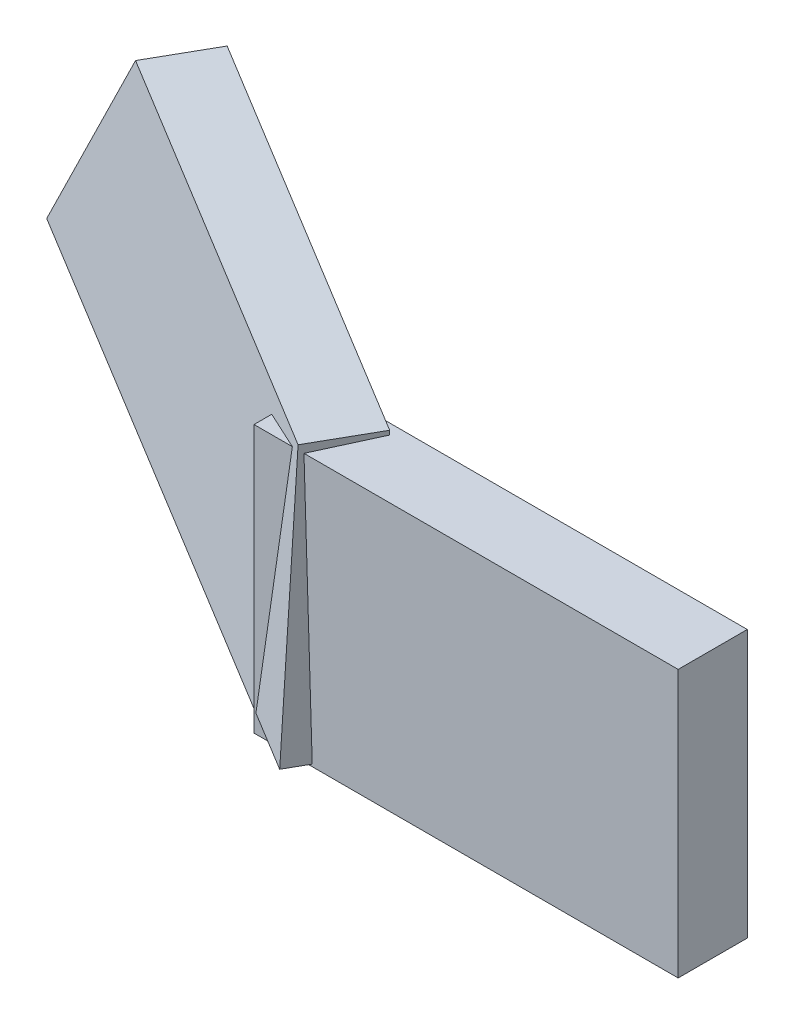
ISO-10303-21;
HEADER;
FILE_DESCRIPTION(('STEP AP214'),'2;1');
FILE_NAME('part.step','',(''),(''),'','','');
FILE_SCHEMA(('AUTOMOTIVE_DESIGN { 1 0 10303 214 1 1 1 1 }'));
ENDSEC;
DATA;
#1=APPLICATION_CONTEXT('core data for automotive mechanical design processes');
#2=APPLICATION_PROTOCOL_DEFINITION('international standard','automotive_design',2000,#1);
#3=PRODUCT_CONTEXT('',#1,'mechanical');
#4=PRODUCT('Part','Part','',(#3));
#5=PRODUCT_RELATED_PRODUCT_CATEGORY('part','',(#4));
#6=PRODUCT_DEFINITION_FORMATION('','',#4);
#7=PRODUCT_DEFINITION_CONTEXT('part definition',#1,'design');
#8=PRODUCT_DEFINITION('design','',#6,#7);
#9=PRODUCT_DEFINITION_SHAPE('','',#8);
#10=(LENGTH_UNIT() NAMED_UNIT(*) SI_UNIT(.MILLI.,.METRE.));
#11=(NAMED_UNIT(*) PLANE_ANGLE_UNIT() SI_UNIT($,.RADIAN.));
#12=(NAMED_UNIT(*) SI_UNIT($,.STERADIAN.) SOLID_ANGLE_UNIT());
#13=UNCERTAINTY_MEASURE_WITH_UNIT(LENGTH_MEASURE(1.E-05),#10,'distance_accuracy_value','');
#14=(GEOMETRIC_REPRESENTATION_CONTEXT(3) GLOBAL_UNCERTAINTY_ASSIGNED_CONTEXT((#13)) GLOBAL_UNIT_ASSIGNED_CONTEXT((#10,
#11,#12)) REPRESENTATION_CONTEXT('',''));
#15=CARTESIAN_POINT('',(0.,0.,0.));
#16=DIRECTION('',(0.,0.,1.));
#17=DIRECTION('',(1.,0.,0.));
#18=AXIS2_PLACEMENT_3D('',#15,#16,#17);
#19=CARTESIAN_POINT('',(0.,0.,0.));
#20=DIRECTION('',(0.,0.,-1.));
#21=DIRECTION('',(-1.,0.,0.));
#22=AXIS2_PLACEMENT_3D('',#19,#20,#21);
#23=PLANE('',#22);
#24=DIRECTION('',(-0.961865813166258,0.273521767802883,0.));
#25=VECTOR('',#24,1.);
#26=CARTESIAN_POINT('',(-4.61141664673298,-16.2164936940404,0.));
#27=LINE('',#26,#25);
#28=CARTESIAN_POINT('',(-49.6705893038957,-3.4032047797039,0.));
#29=VERTEX_POINT('',#28);
#30=CARTESIAN_POINT('',(-51.0884980005884,-3.,0.));
#31=VERTEX_POINT('',#30);
#32=EDGE_CURVE('E47',#29,#31,#27,.T.);
#33=ORIENTED_EDGE('',*,*,#32,.F.);
#34=DIRECTION('',(0.272494302658222,0.962157396177366,0.));
#35=VECTOR('',#34,1.);
#36=CARTESIAN_POINT('',(-45.0901314085063,12.7700560882697,0.));
#37=LINE('',#36,#35);
#38=CARTESIAN_POINT('',(-49.5563969631099,-3.00000000000001,0.));
#39=VERTEX_POINT('',#38);
#40=EDGE_CURVE('E243',#29,#39,#37,.T.);
#41=ORIENTED_EDGE('',*,*,#40,.T.);
#42=DIRECTION('',(-1.,0.,0.));
#43=VECTOR('',#42,1.);
#44=CARTESIAN_POINT('',(0.,-3.,0.));
#45=LINE('',#44,#43);
#46=CARTESIAN_POINT('',(2.76550135112785,-3.,0.));
#47=VERTEX_POINT('',#46);
#48=EDGE_CURVE('E266',#47,#39,#45,.T.);
#49=ORIENTED_EDGE('',*,*,#48,.F.);
#50=DIRECTION('',(0.,1.,0.));
#51=VECTOR('',#50,1.);
#52=CARTESIAN_POINT('',(2.76550135112785,0.,0.));
#53=LINE('',#52,#51);
#54=CARTESIAN_POINT('',(2.76550135112785,0.,0.));
#55=VERTEX_POINT('',#54);
#56=EDGE_CURVE('E382',#47,#55,#53,.T.);
#57=ORIENTED_EDGE('',*,*,#56,.T.);
#58=DIRECTION('',(-1.,0.,0.));
#59=VECTOR('',#58,1.);
#60=CARTESIAN_POINT('',(0.,0.,0.));
#61=LINE('',#60,#59);
#62=CARTESIAN_POINT('',(-50.6495849571102,0.,0.));
#63=VERTEX_POINT('',#62);
#64=EDGE_CURVE('E263',#55,#63,#61,.T.);
#65=ORIENTED_EDGE('',*,*,#64,.T.);
#66=DIRECTION('',(-0.144763225394545,-0.989466325133588,0.));
#67=VECTOR('',#66,1.);
#68=CARTESIAN_POINT('',(-49.5881524291525,7.25496230104778,0.));
#69=LINE('',#68,#67);
#70=CARTESIAN_POINT('',(-46.3103047634157,29.6592702689367,0.));
#71=VERTEX_POINT('',#70);
#72=EDGE_CURVE('E365',#71,#63,#69,.T.);
#73=ORIENTED_EDGE('',*,*,#72,.F.);
#74=DIRECTION('',(-1.,0.,0.));
#75=VECTOR('',#74,1.);
#76=CARTESIAN_POINT('',(7.24698608871676,29.6592702689367,0.));
#77=LINE('',#76,#75);
#78=CARTESIAN_POINT('',(7.24698608871676,29.6592702689367,0.));
#79=VERTEX_POINT('',#78);
#80=EDGE_CURVE('E347',#79,#71,#77,.T.);
#81=ORIENTED_EDGE('',*,*,#80,.F.);
#82=DIRECTION('',(0.,1.,0.));
#83=VECTOR('',#82,1.);
#84=CARTESIAN_POINT('',(7.24698608871676,29.6592702689367,0.));
#85=LINE('',#84,#83);
#86=CARTESIAN_POINT('',(7.24698608871676,-8.99815359159106,0.));
#87=VERTEX_POINT('',#86);
#88=EDGE_CURVE('E331',#87,#79,#85,.T.);
#89=ORIENTED_EDGE('',*,*,#88,.F.);
#90=DIRECTION('',(1.,0.,0.));
#91=VECTOR('',#90,1.);
#92=CARTESIAN_POINT('',(7.24698608871676,-8.99815359159106,0.));
#93=LINE('',#92,#91);
#94=CARTESIAN_POINT('',(-54.0980263978099,-8.99815359159107,0.));
#95=VERTEX_POINT('',#94);
#96=EDGE_CURVE('E336',#95,#87,#93,.T.);
#97=ORIENTED_EDGE('',*,*,#96,.F.);
#98=DIRECTION('',(0.,-1.,0.));
#99=VECTOR('',#98,1.);
#100=CARTESIAN_POINT('',(-54.0980263978099,29.6592702689367,0.));
#101=LINE('',#100,#99);
#102=CARTESIAN_POINT('',(-54.0980263978099,-5.63992298781213,0.));
#103=VERTEX_POINT('',#102);
#104=EDGE_CURVE('E350',#103,#95,#101,.T.);
#105=ORIENTED_EDGE('',*,*,#104,.F.);
#106=DIRECTION('',(0.961865813166258,-0.273521767802883,0.));
#107=VECTOR('',#106,1.);
#108=CARTESIAN_POINT('',(-5.53111258417819,-19.4506936183914,0.));
#109=LINE('',#108,#107);
#110=CARTESIAN_POINT('',(-51.579510441003,-6.35610286167416,0.));
#111=VERTEX_POINT('',#110);
#112=EDGE_CURVE('E368',#103,#111,#109,.T.);
#113=ORIENTED_EDGE('',*,*,#112,.T.);
#114=EDGE_CURVE('E364',#31,#111,#69,.T.);
#115=ORIENTED_EDGE('',*,*,#114,.F.);
#116=EDGE_LOOP('',(#33,#41,#49,#57,#65,#73,#81,#89,#97,#105,#113,#115));
#117=FACE_BOUND('',#116,.T.);
#118=ADVANCED_FACE('F32',(#117),#23,.T.);
#119=CARTESIAN_POINT('',(2.76550135112785,-3.,-3.55568919306926));
#120=DIRECTION('',(0.,0.,1.));
#121=DIRECTION('',(0.,-1.,0.));
#122=AXIS2_PLACEMENT_3D('',#119,#120,#121);
#123=PLANE('',#122);
#124=DIRECTION('',(-0.140938665209173,-0.990018329451055,0.));
#125=VECTOR('',#124,1.);
#126=CARTESIAN_POINT('',(-50.3457598065941,4.5609006747336,-3.55568919306925));
#127=LINE('',#126,#125);
#128=CARTESIAN_POINT('',(-50.9950480410907,0.,-3.55568919306926));
#129=VERTEX_POINT('',#128);
#130=CARTESIAN_POINT('',(-51.3780913025386,-2.69067291962336,-3.55568919306926));
#131=VERTEX_POINT('',#130);
#132=EDGE_CURVE('E224',#129,#131,#127,.T.);
#133=ORIENTED_EDGE('',*,*,#132,.F.);
#134=DIRECTION('',(1.,0.,0.));
#135=VECTOR('',#134,1.);
#136=CARTESIAN_POINT('',(2.76550135112785,0.,-3.55568919306926));
#137=LINE('',#136,#135);
#138=CARTESIAN_POINT('',(2.76550135112785,0.,-3.55568919306926));
#139=VERTEX_POINT('',#138);
#140=EDGE_CURVE('E250',#129,#139,#137,.T.);
#141=ORIENTED_EDGE('',*,*,#140,.T.);
#142=DIRECTION('',(0.,1.,0.));
#143=VECTOR('',#142,1.);
#144=CARTESIAN_POINT('',(2.76550135112785,-3.,-3.55568919306926));
#145=LINE('',#144,#143);
#146=CARTESIAN_POINT('',(2.76550135112785,-3.,-3.55568919306926));
#147=VERTEX_POINT('',#146);
#148=EDGE_CURVE('E254',#147,#139,#145,.T.);
#149=ORIENTED_EDGE('',*,*,#148,.F.);
#150=DIRECTION('',(1.,0.,0.));
#151=VECTOR('',#150,1.);
#152=CARTESIAN_POINT('',(2.76550135112785,-3.,-3.55568919306926));
#153=LINE('',#152,#151);
#154=CARTESIAN_POINT('',(-52.8877179020384,-3.00000000000001,-3.55568919306926));
#155=VERTEX_POINT('',#154);
#156=EDGE_CURVE('E252',#155,#147,#153,.T.);
#157=ORIENTED_EDGE('',*,*,#156,.F.);
#158=DIRECTION('',(0.,1.,0.));
#159=VECTOR('',#158,1.);
#160=CARTESIAN_POINT('',(-52.8877179020384,-3.00000000000001,-3.55568919306926));
#161=LINE('',#160,#159);
#162=CARTESIAN_POINT('',(-52.8877179020384,-2.26138670260084,-3.55568919306926));
#163=VERTEX_POINT('',#162);
#164=EDGE_CURVE('E260',#155,#163,#161,.T.);
#165=ORIENTED_EDGE('',*,*,#164,.T.);
#166=DIRECTION('',(0.961865813166258,-0.273521767802883,0.));
#167=VECTOR('',#166,1.);
#168=CARTESIAN_POINT('',(-1.20382467082125,-16.9585197642314,-3.55568919306926));
#169=LINE('',#168,#167);
#170=EDGE_CURVE('E238',#163,#131,#169,.T.);
#171=ORIENTED_EDGE('',*,*,#170,.T.);
#172=EDGE_LOOP('',(#133,#141,#149,#157,#165,#171));
#173=FACE_BOUND('',#172,.T.);
#174=ADVANCED_FACE('F447',(#173),#123,.F.);
#175=CARTESIAN_POINT('',(0.,-3.,0.));
#176=DIRECTION('',(0.,-1.,0.));
#177=DIRECTION('',(0.,0.,-1.));
#178=AXIS2_PLACEMENT_3D('',#175,#176,#177);
#179=PLANE('',#178);
#180=ORIENTED_EDGE('',*,*,#48,.T.);
#181=DIRECTION('',(-0.0180758078639495,0.,-0.999836619238396));
#182=VECTOR('',#181,1.);
#183=CARTESIAN_POINT('',(-49.540205162176,-3.00000000000001,0.895625558037916));
#184=LINE('',#183,#182);
#185=CARTESIAN_POINT('',(-49.6059194906359,-3.00000000000001,-2.73926547960387));
#186=VERTEX_POINT('',#185);
#187=EDGE_CURVE('E40',#39,#186,#184,.T.);
#188=ORIENTED_EDGE('',*,*,#187,.T.);
#189=DIRECTION('',(-0.912084869393393,0.,-0.410001452465277));
#190=VECTOR('',#189,1.);
#191=CARTESIAN_POINT('',(-7.31444905444608,-3.,16.2716455524608));
#192=LINE('',#191,#190);
#193=CARTESIAN_POINT('',(-50.3940544585833,-3.,-3.09354882805152));
#194=VERTEX_POINT('',#193);
#195=EDGE_CURVE('E235',#186,#194,#192,.T.);
#196=ORIENTED_EDGE('',*,*,#195,.T.);
#197=DIRECTION('',(0.219030354150285,0.,-0.975718045318831));
#198=VECTOR('',#197,1.);
#199=CARTESIAN_POINT('',(-48.63756327331,-3.,-10.9182183929773));
#200=LINE('',#199,#198);
#201=EDGE_CURVE('E390',#31,#194,#200,.T.);
#202=ORIENTED_EDGE('',*,*,#201,.F.);
#203=DIRECTION('',(-0.907673758740521,0.,-0.419676479795872));
#204=VECTOR('',#203,1.);
#205=CARTESIAN_POINT('',(-8.99813273900444,-3.,19.4611072053189));
#206=LINE('',#205,#204);
#207=CARTESIAN_POINT('',(-52.8877179020384,-3.00000000000001,-0.83189611614083));
#208=VERTEX_POINT('',#207);
#209=EDGE_CURVE('E379',#31,#208,#206,.T.);
#210=ORIENTED_EDGE('',*,*,#209,.T.);
#211=DIRECTION('',(0.,0.,-1.));
#212=VECTOR('',#211,1.);
#213=CARTESIAN_POINT('',(-52.8877179020384,-3.00000000000001,-3.55568919306926));
#214=LINE('',#213,#212);
#215=EDGE_CURVE('E249',#208,#155,#214,.T.);
#216=ORIENTED_EDGE('',*,*,#215,.T.);
#217=ORIENTED_EDGE('',*,*,#156,.T.);
#218=DIRECTION('',(0.,0.,1.));
#219=VECTOR('',#218,1.);
#220=CARTESIAN_POINT('',(2.76550135112785,-3.,-3.55568919306926));
#221=LINE('',#220,#219);
#222=EDGE_CURVE('E246',#147,#47,#221,.T.);
#223=ORIENTED_EDGE('',*,*,#222,.T.);
#224=EDGE_LOOP('',(#180,#188,#196,#202,#210,#216,#217,#223));
#225=FACE_BOUND('',#224,.T.);
#226=ADVANCED_FACE('F395',(#225),#179,.T.);
#227=CARTESIAN_POINT('',(0.,0.,0.));
#228=DIRECTION('',(0.,-1.,0.));
#229=DIRECTION('',(0.,0.,-1.));
#230=AXIS2_PLACEMENT_3D('',#227,#228,#229);
#231=PLANE('',#230);
#232=DIRECTION('',(-0.912084869393393,0.,-0.410001452465277));
#233=VECTOR('',#232,1.);
#234=CARTESIAN_POINT('',(-7.24265657310057,0.,16.1119367622169));
#235=LINE('',#234,#233);
#236=CARTESIAN_POINT('',(-49.9562261245125,0.,-3.08871675558866));
#237=VERTEX_POINT('',#236);
#238=EDGE_CURVE('E388',#237,#129,#235,.T.);
#239=ORIENTED_EDGE('',*,*,#238,.F.);
#240=DIRECTION('',(0.219030354150285,0.,-0.975718045318831));
#241=VECTOR('',#240,1.);
#242=CARTESIAN_POINT('',(-48.219706774115,0.,-10.8244174661197));
#243=LINE('',#242,#241);
#244=EDGE_CURVE('E385',#63,#237,#243,.T.);
#245=ORIENTED_EDGE('',*,*,#244,.F.);
#246=ORIENTED_EDGE('',*,*,#64,.F.);
#247=DIRECTION('',(0.,0.,1.));
#248=VECTOR('',#247,1.);
#249=CARTESIAN_POINT('',(2.76550135112785,0.,-3.55568919306926));
#250=LINE('',#249,#248);
#251=EDGE_CURVE('E245',#139,#55,#250,.T.);
#252=ORIENTED_EDGE('',*,*,#251,.F.);
#253=ORIENTED_EDGE('',*,*,#140,.F.);
#254=EDGE_LOOP('',(#239,#245,#246,#252,#253));
#255=FACE_BOUND('',#254,.T.);
#256=ADVANCED_FACE('F439',(#255),#231,.F.);
#257=CARTESIAN_POINT('',(7.24698608871676,29.6592702689367,10.));
#258=DIRECTION('',(0.,-1.,0.));
#259=DIRECTION('',(1.,0.,0.));
#260=AXIS2_PLACEMENT_3D('',#257,#258,#259);
#261=PLANE('',#260);
#262=DIRECTION('',(0.907673758740521,0.,0.419676479795872));
#263=VECTOR('',#262,1.);
#264=CARTESIAN_POINT('',(-2.58134607810966,29.6592702689367,31.2566575195084));
#265=LINE('',#264,#263);
#266=CARTESIAN_POINT('',(-54.0980263978099,29.6592702689367,7.43715316659942));
#267=VERTEX_POINT('',#266);
#268=CARTESIAN_POINT('',(-48.5551167272932,29.6592702689367,10.));
#269=VERTEX_POINT('',#268);
#270=EDGE_CURVE('E320',#267,#269,#265,.T.);
#271=ORIENTED_EDGE('',*,*,#270,.F.);
#272=DIRECTION('',(0.,0.,-1.));
#273=VECTOR('',#272,1.);
#274=CARTESIAN_POINT('',(-54.0980263978099,29.6592702689367,10.));
#275=LINE('',#274,#273);
#276=CARTESIAN_POINT('',(-54.0980263978099,29.6592702689367,10.));
#277=VERTEX_POINT('',#276);
#278=EDGE_CURVE('E358',#277,#267,#275,.T.);
#279=ORIENTED_EDGE('',*,*,#278,.F.);
#280=DIRECTION('',(-1.,0.,0.));
#281=VECTOR('',#280,1.);
#282=CARTESIAN_POINT('',(7.24698608871676,29.6592702689367,10.));
#283=LINE('',#282,#281);
#284=EDGE_CURVE('E335',#269,#277,#283,.T.);
#285=ORIENTED_EDGE('',*,*,#284,.F.);
#286=EDGE_LOOP('',(#271,#279,#285));
#287=FACE_BOUND('',#286,.T.);
#288=ADVANCED_FACE('F478',(#287),#261,.F.);
#289=DIRECTION('',(0.41809960286183,0.,-0.908401190051389));
#290=VECTOR('',#289,1.);
#291=CARTESIAN_POINT('',(-37.4131117155012,29.6592702689367,-10.5552011162135));
#292=LINE('',#291,#290);
#293=CARTESIAN_POINT('',(-46.8738230372772,29.6592702689367,10.));
#294=VERTEX_POINT('',#293);
#295=CARTESIAN_POINT('',(-42.9799581669597,29.6592702689367,1.53983534573065));
#296=VERTEX_POINT('',#295);
#297=EDGE_CURVE('E326',#294,#296,#292,.T.);
#298=ORIENTED_EDGE('',*,*,#297,.F.);
#299=CARTESIAN_POINT('',(7.24698608871676,29.6592702689367,10.));
#300=VERTEX_POINT('',#299);
#301=EDGE_CURVE('E337',#300,#294,#283,.T.);
#302=ORIENTED_EDGE('',*,*,#301,.F.);
#303=DIRECTION('',(0.,0.,-1.));
#304=VECTOR('',#303,1.);
#305=CARTESIAN_POINT('',(7.24698608871676,29.6592702689367,10.));
#306=LINE('',#305,#304);
#307=EDGE_CURVE('E361',#300,#79,#306,.T.);
#308=ORIENTED_EDGE('',*,*,#307,.T.);
#309=ORIENTED_EDGE('',*,*,#80,.T.);
#310=DIRECTION('',(0.907673758740521,0.,0.419676479795872));
#311=VECTOR('',#310,1.);
#312=CARTESIAN_POINT('',(1.62332222268456,29.6592702689367,22.1628262838496));
#313=LINE('',#312,#311);
#314=EDGE_CURVE('E306',#71,#296,#313,.T.);
#315=ORIENTED_EDGE('',*,*,#314,.T.);
#316=EDGE_LOOP('',(#298,#302,#308,#309,#315));
#317=FACE_BOUND('',#316,.T.);
#318=ADVANCED_FACE('F434',(#317),#261,.F.);
#319=CARTESIAN_POINT('',(-54.0980263978099,29.6592702689367,10.));
#320=DIRECTION('',(1.,0.,0.));
#321=DIRECTION('',(0.,0.,-1.));
#322=AXIS2_PLACEMENT_3D('',#319,#320,#321);
#323=PLANE('',#322);
#324=DIRECTION('',(0.,-0.0637051177691882,0.997968766029285));
#325=VECTOR('',#324,1.);
#326=CARTESIAN_POINT('',(-54.0980263978099,-6.13242396589234,7.71524503170508));
#327=LINE('',#326,#325);
#328=CARTESIAN_POINT('',(-54.0980263978099,-6.26981985192626,9.86761218279604));
#329=VERTEX_POINT('',#328);
#330=EDGE_CURVE('E311',#103,#329,#327,.T.);
#331=ORIENTED_EDGE('',*,*,#330,.F.);
#332=ORIENTED_EDGE('',*,*,#104,.T.);
#333=DIRECTION('',(0.,0.,-1.));
#334=VECTOR('',#333,1.);
#335=CARTESIAN_POINT('',(-54.0980263978099,-8.99815359159107,10.));
#336=LINE('',#335,#334);
#337=CARTESIAN_POINT('',(-54.0980263978099,-8.99815359159107,10.));
#338=VERTEX_POINT('',#337);
#339=EDGE_CURVE('E355',#338,#95,#336,.T.);
#340=ORIENTED_EDGE('',*,*,#339,.F.);
#341=DIRECTION('',(0.,-1.,0.));
#342=VECTOR('',#341,1.);
#343=CARTESIAN_POINT('',(-54.0980263978099,29.6592702689367,10.));
#344=LINE('',#343,#342);
#345=EDGE_CURVE('E340',#277,#338,#344,.T.);
#346=ORIENTED_EDGE('',*,*,#345,.F.);
#347=ORIENTED_EDGE('',*,*,#278,.T.);
#348=DIRECTION('',(0.,0.99771983227015,-0.0674917498278393));
#349=VECTOR('',#348,1.);
#350=CARTESIAN_POINT('',(-54.0980263978099,29.4866936545416,7.44882728322832));
#351=LINE('',#350,#349);
#352=EDGE_CURVE('E323',#329,#267,#351,.T.);
#353=ORIENTED_EDGE('',*,*,#352,.F.);
#354=EDGE_LOOP('',(#331,#332,#340,#346,#347,#353));
#355=FACE_BOUND('',#354,.T.);
#356=ADVANCED_FACE('F474',(#355),#323,.F.);
#357=CARTESIAN_POINT('',(7.24698608871676,-8.99815359159106,10.));
#358=DIRECTION('',(0.,1.,0.));
#359=DIRECTION('',(-1.,0.,0.));
#360=AXIS2_PLACEMENT_3D('',#357,#358,#359);
#361=PLANE('',#360);
#362=ORIENTED_EDGE('',*,*,#96,.T.);
#363=DIRECTION('',(0.,0.,-1.));
#364=VECTOR('',#363,1.);
#365=CARTESIAN_POINT('',(7.24698608871676,-8.99815359159106,10.));
#366=LINE('',#365,#364);
#367=CARTESIAN_POINT('',(7.24698608871676,-8.99815359159106,10.));
#368=VERTEX_POINT('',#367);
#369=EDGE_CURVE('E344',#368,#87,#366,.T.);
#370=ORIENTED_EDGE('',*,*,#369,.F.);
#371=DIRECTION('',(1.,0.,0.));
#372=VECTOR('',#371,1.);
#373=CARTESIAN_POINT('',(7.24698608871676,-8.99815359159106,10.));
#374=LINE('',#373,#372);
#375=EDGE_CURVE('E342',#338,#368,#374,.T.);
#376=ORIENTED_EDGE('',*,*,#375,.F.);
#377=ORIENTED_EDGE('',*,*,#339,.T.);
#378=EDGE_LOOP('',(#362,#370,#376,#377));
#379=FACE_BOUND('',#378,.T.);
#380=DIRECTION('',(0.219030354150285,0.,-0.975718045318831));
#381=VECTOR('',#380,1.);
#382=CARTESIAN_POINT('',(-42.0491723502563,-8.99815359159106,-1.0660606237006));
#383=LINE('',#382,#381);
#384=CARTESIAN_POINT('',(-43.4508246825254,-8.99815359159114,5.17790258936282));
#385=VERTEX_POINT('',#384);
#386=CARTESIAN_POINT('',(-43.1984880773485,-8.99815359159106,4.05381465131765));
#387=VERTEX_POINT('',#386);
#388=EDGE_CURVE('E317',#385,#387,#383,.T.);
#389=ORIENTED_EDGE('',*,*,#388,.F.);
#390=DIRECTION('',(-0.41809960286183,0.,0.908401190051389));
#391=VECTOR('',#390,1.);
#392=CARTESIAN_POINT('',(-36.4199214787452,-8.99815359159106,-10.0980766120829));
#393=LINE('',#392,#391);
#394=CARTESIAN_POINT('',(-42.9799581669597,-8.99815359159106,4.15485520982114));
#395=VERTEX_POINT('',#394);
#396=EDGE_CURVE('E329',#395,#385,#393,.T.);
#397=ORIENTED_EDGE('',*,*,#396,.F.);
#398=DIRECTION('',(-0.907673758740521,0.,-0.419676479795872));
#399=VECTOR('',#398,1.);
#400=CARTESIAN_POINT('',(0.627184463486448,-8.99815359159106,24.3172670200912));
#401=LINE('',#400,#399);
#402=EDGE_CURVE('E308',#395,#387,#401,.T.);
#403=ORIENTED_EDGE('',*,*,#402,.T.);
#404=EDGE_LOOP('',(#389,#397,#403));
#405=FACE_BOUND('',#404,.T.);
#406=ADVANCED_FACE('F471',(#379,#405),#361,.F.);
#407=CARTESIAN_POINT('',(0.,0.,10.));
#408=DIRECTION('',(0.,0.,-1.));
#409=DIRECTION('',(-1.,0.,0.));
#410=AXIS2_PLACEMENT_3D('',#407,#408,#409);
#411=PLANE('',#410);
#412=DIRECTION('',(-0.0311195816571302,0.999515668530256,0.));
#413=VECTOR('',#412,1.);
#414=CARTESIAN_POINT('',(-45.9058920448008,-1.42926439375606,10.));
#415=LINE('',#414,#413);
#416=CARTESIAN_POINT('',(-45.6803932329449,-8.67195801888853,10.));
#417=VERTEX_POINT('',#416);
#418=EDGE_CURVE('E374',#417,#294,#415,.T.);
#419=ORIENTED_EDGE('',*,*,#418,.F.);
#420=DIRECTION('',(0.961865813166258,-0.273521767802883,0.));
#421=VECTOR('',#420,1.);
#422=CARTESIAN_POINT('',(-5.69905629991633,-20.0412839761616,10.));
#423=LINE('',#422,#421);
#424=CARTESIAN_POINT('',(-53.8243224048804,-6.35610286167416,10.));
#425=VERTEX_POINT('',#424);
#426=EDGE_CURVE('E314',#425,#417,#423,.T.);
#427=ORIENTED_EDGE('',*,*,#426,.F.);
#428=DIRECTION('',(-0.144763225394545,-0.989466325133588,0.));
#429=VECTOR('',#428,1.);
#430=CARTESIAN_POINT('',(-51.7859212348358,7.57650543283579,10.));
#431=LINE('',#430,#429);
#432=EDGE_CURVE('E371',#269,#425,#431,.T.);
#433=ORIENTED_EDGE('',*,*,#432,.F.);
#434=ORIENTED_EDGE('',*,*,#284,.T.);
#435=ORIENTED_EDGE('',*,*,#345,.T.);
#436=ORIENTED_EDGE('',*,*,#375,.T.);
#437=DIRECTION('',(0.,1.,0.));
#438=VECTOR('',#437,1.);
#439=CARTESIAN_POINT('',(7.24698608871676,29.6592702689367,10.));
#440=LINE('',#439,#438);
#441=EDGE_CURVE('E332',#368,#300,#440,.T.);
#442=ORIENTED_EDGE('',*,*,#441,.T.);
#443=ORIENTED_EDGE('',*,*,#301,.T.);
#444=EDGE_LOOP('',(#419,#427,#433,#434,#435,#436,#442,#443));
#445=FACE_BOUND('',#444,.T.);
#446=ADVANCED_FACE('F469',(#445),#411,.F.);
#447=CARTESIAN_POINT('',(7.24698608871676,29.6592702689367,10.));
#448=DIRECTION('',(-1.,0.,0.));
#449=DIRECTION('',(0.,0.,1.));
#450=AXIS2_PLACEMENT_3D('',#447,#448,#449);
#451=PLANE('',#450);
#452=ORIENTED_EDGE('',*,*,#88,.T.);
#453=ORIENTED_EDGE('',*,*,#307,.F.);
#454=ORIENTED_EDGE('',*,*,#441,.F.);
#455=ORIENTED_EDGE('',*,*,#369,.T.);
#456=EDGE_LOOP('',(#452,#453,#454,#455));
#457=FACE_BOUND('',#456,.T.);
#458=ADVANCED_FACE('F34',(#457),#451,.F.);
#459=CARTESIAN_POINT('',(-92.6970467117008,45.2175593343169,-11.4621346370394));
#460=DIRECTION('',(-0.273007629727593,-0.960057796781159,-0.0612850793442331));
#461=DIRECTION('',(0.961865813166258,-0.273521767802883,0.));
#462=AXIS2_PLACEMENT_3D('',#459,#460,#461);
#463=PLANE('',#462);
#464=DIRECTION('',(-0.866025403784438,0.273007629727593,-0.418887615131461));
#465=VECTOR('',#464,1.);
#466=CARTESIAN_POINT('',(-88.5081705603862,44.6047085408746,-20.5218107070722));
#467=LINE('',#466,#465);
#468=CARTESIAN_POINT('',(-42.9799581669597,30.2523012131588,1.49971917801195));
#469=VERTEX_POINT('',#468);
#470=CARTESIAN_POINT('',(-88.5081705603862,44.6047085408746,-20.5218107070722));
#471=VERTEX_POINT('',#470);
#472=EDGE_CURVE('E274',#469,#471,#467,.T.);
#473=ORIENTED_EDGE('',*,*,#472,.T.);
#474=DIRECTION('',(0.418887615131461,-0.0612850793442335,-0.905967607003279));
#475=VECTOR('',#474,1.);
#476=CARTESIAN_POINT('',(-92.6970467117008,45.2175593343169,-11.4621346370394));
#477=LINE('',#476,#475);
#478=CARTESIAN_POINT('',(-92.6970467117008,45.2175593343169,-11.4621346370394));
#479=VERTEX_POINT('',#478);
#480=EDGE_CURVE('E282',#479,#471,#477,.T.);
#481=ORIENTED_EDGE('',*,*,#480,.F.);
#482=DIRECTION('',(-0.866025403784438,0.273007629727593,-0.418887615131461));
#483=VECTOR('',#482,1.);
#484=CARTESIAN_POINT('',(-92.6970467117008,45.2175593343169,-11.4621346370394));
#485=LINE('',#484,#483);
#486=CARTESIAN_POINT('',(-47.1688343182743,30.8651520066011,10.5593952480447));
#487=VERTEX_POINT('',#486);
#488=EDGE_CURVE('E280',#487,#479,#485,.T.);
#489=ORIENTED_EDGE('',*,*,#488,.F.);
#490=DIRECTION('',(0.418887615131461,-0.0612850793442335,-0.905967607003279));
#491=VECTOR('',#490,1.);
#492=CARTESIAN_POINT('',(-47.1688343182743,30.8651520066011,10.5593952480447));
#493=LINE('',#492,#491);
#494=EDGE_CURVE('E296',#487,#469,#493,.T.);
#495=ORIENTED_EDGE('',*,*,#494,.T.);
#496=EDGE_LOOP('',(#473,#481,#489,#495));
#497=FACE_BOUND('',#496,.T.);
#498=ADVANCED_FACE('F426',(#497),#463,.F.);
#499=CARTESIAN_POINT('',(-112.435292607443,12.1205399493942,-18.349525800751));
#500=DIRECTION('',(0.755182335838674,-0.530501138308105,0.385056076294154));
#501=DIRECTION('',(0.574823989297973,0.818277081023026,0.));
#502=AXIS2_PLACEMENT_3D('',#499,#500,#501);
#503=PLANE('',#502);
#504=DIRECTION('',(-0.504215038973176,-0.845465955141646,-0.17593894727917));
#505=VECTOR('',#504,1.);
#506=CARTESIAN_POINT('',(-108.246416456129,11.5076891559518,-27.4092018707838));
#507=LINE('',#506,#505);
#508=CARTESIAN_POINT('',(-108.246416456129,11.5076891559518,-27.4092018707838));
#509=VERTEX_POINT('',#508);
#510=EDGE_CURVE('E269',#471,#509,#507,.T.);
#511=ORIENTED_EDGE('',*,*,#510,.T.);
#512=DIRECTION('',(0.418887615131461,-0.0612850793442335,-0.905967607003279));
#513=VECTOR('',#512,1.);
#514=CARTESIAN_POINT('',(-112.435292607443,12.1205399493942,-18.349525800751));
#515=LINE('',#514,#513);
#516=CARTESIAN_POINT('',(-112.435292607443,12.1205399493942,-18.349525800751));
#517=VERTEX_POINT('',#516);
#518=EDGE_CURVE('E303',#517,#509,#515,.T.);
#519=ORIENTED_EDGE('',*,*,#518,.F.);
#520=DIRECTION('',(-0.504215038973176,-0.845465955141646,-0.17593894727917));
#521=VECTOR('',#520,1.);
#522=CARTESIAN_POINT('',(-112.435292607443,12.1205399493942,-18.349525800751));
#523=LINE('',#522,#521);
#524=EDGE_CURVE('E270',#479,#517,#523,.T.);
#525=ORIENTED_EDGE('',*,*,#524,.F.);
#526=ORIENTED_EDGE('',*,*,#480,.T.);
#527=EDGE_LOOP('',(#511,#519,#525,#526));
#528=FACE_BOUND('',#527,.T.);
#529=ADVANCED_FACE('F421',(#528),#503,.F.);
#530=CARTESIAN_POINT('',(-8.88732232143609,1.30025389615794,19.2214471026827));
#531=DIRECTION('',(0.418887615131461,-0.0612850793442335,-0.905967607003279));
#532=DIRECTION('',(-0.907673758740521,0.,-0.419676479795872));
#533=AXIS2_PLACEMENT_3D('',#530,#531,#532);
#534=PLANE('',#533);
#535=DIRECTION('',(-0.866025403784438,0.273007629727593,-0.418887615131461));
#536=VECTOR('',#535,1.);
#537=CARTESIAN_POINT('',(-13.4814191284604,-14.8553329024674,18.1901587551207));
#538=LINE('',#537,#536);
#539=CARTESIAN_POINT('',(-52.8877179020384,-2.43281021722098,-0.870264232806534));
#540=VERTEX_POINT('',#539);
#541=CARTESIAN_POINT('',(-100.42887279792,12.554161245648,-23.8654337831539));
#542=VERTEX_POINT('',#541);
#543=EDGE_CURVE('E205',#540,#542,#538,.T.);
#544=ORIENTED_EDGE('',*,*,#543,.F.);
#545=DIRECTION('',(0.,-0.99771983227015,0.0674917498278393));
#546=VECTOR('',#545,1.);
#547=CARTESIAN_POINT('',(-52.8877179020384,-0.0696835108564423,-1.03012028790223));
#548=LINE('',#547,#546);
#549=EDGE_CURVE('E377',#540,#208,#548,.T.);
#550=ORIENTED_EDGE('',*,*,#549,.T.);
#551=ORIENTED_EDGE('',*,*,#209,.F.);
#552=ORIENTED_EDGE('',*,*,#114,.T.);
#553=DIRECTION('',(0.866025403784438,-0.273007629727593,0.418887615131461));
#554=VECTOR('',#553,1.);
#555=CARTESIAN_POINT('',(-42.9799581669597,-9.0670434100642,4.15951533007102));
#556=LINE('',#555,#554);
#557=EDGE_CURVE('E286',#509,#111,#556,.T.);
#558=ORIENTED_EDGE('',*,*,#557,.F.);
#559=ORIENTED_EDGE('',*,*,#510,.F.);
#560=ORIENTED_EDGE('',*,*,#472,.F.);
#561=DIRECTION('',(0.,0.99771983227015,-0.0674917498278393));
#562=VECTOR('',#561,1.);
#563=CARTESIAN_POINT('',(-42.9799581669597,30.2523012131588,1.49971917801195));
#564=LINE('',#563,#562);
#565=EDGE_CURVE('E289',#296,#469,#564,.T.);
#566=ORIENTED_EDGE('',*,*,#565,.F.);
#567=ORIENTED_EDGE('',*,*,#314,.F.);
#568=ORIENTED_EDGE('',*,*,#72,.T.);
#569=DIRECTION('',(-0.866025403784438,0.273007629727593,-0.418887615131461));
#570=VECTOR('',#569,1.);
#571=CARTESIAN_POINT('',(-12.6623962392776,-11.9751595121239,18.3740139931534));
#572=LINE('',#571,#570);
#573=CARTESIAN_POINT('',(-99.609849908737,15.4343346359914,-23.6815785451212));
#574=VERTEX_POINT('',#573);
#575=EDGE_CURVE('E218',#63,#574,#572,.T.);
#576=ORIENTED_EDGE('',*,*,#575,.T.);
#577=DIRECTION('',(-0.273007629727593,-0.960057796781159,-0.061285079344233));
#578=VECTOR('',#577,1.);
#579=CARTESIAN_POINT('',(-95.8347759908955,28.7097480442733,-22.8341454355919));
#580=LINE('',#579,#578);
#581=EDGE_CURVE('E11',#574,#542,#580,.T.);
#582=ORIENTED_EDGE('',*,*,#581,.T.);
#583=EDGE_LOOP('',(#544,#550,#551,#552,#558,#559,#560,#566,#567,#568,#576,#582));
#584=FACE_BOUND('',#583,.T.);
#585=ADVANCED_FACE('F409',(#584),#534,.T.);
#586=CARTESIAN_POINT('',(-47.1688343182743,-8.45419261662187,13.2191914001038));
#587=DIRECTION('',(0.273007629727593,0.960057796781159,0.061285079344233));
#588=DIRECTION('',(-0.961865813166258,0.273521767802883,0.));
#589=AXIS2_PLACEMENT_3D('',#586,#587,#588);
#590=PLANE('',#589);
#591=ORIENTED_EDGE('',*,*,#112,.F.);
#592=ORIENTED_EDGE('',*,*,#330,.T.);
#593=DIRECTION('',(0.866025403784438,-0.273007629727593,0.418887615131461));
#594=VECTOR('',#593,1.);
#595=CARTESIAN_POINT('',(-47.1688343182743,-8.45419261662187,13.2191914001038));
#596=LINE('',#595,#594);
#597=EDGE_CURVE('E275',#517,#329,#596,.T.);
#598=ORIENTED_EDGE('',*,*,#597,.F.);
#599=ORIENTED_EDGE('',*,*,#518,.T.);
#600=ORIENTED_EDGE('',*,*,#557,.T.);
#601=EDGE_LOOP('',(#591,#592,#598,#599,#600));
#602=FACE_BOUND('',#601,.T.);
#603=ADVANCED_FACE('F415',(#602),#590,.F.);
#604=CARTESIAN_POINT('',(-47.1688343182743,-8.45419261662187,13.2191914001038));
#605=VERTEX_POINT('',#604);
#606=EDGE_CURVE('E273',#425,#605,#596,.T.);
#607=ORIENTED_EDGE('',*,*,#606,.F.);
#608=ORIENTED_EDGE('',*,*,#426,.T.);
#609=DIRECTION('',(0.418887615131461,-0.0612850793442335,-0.905967607003279));
#610=VECTOR('',#609,1.);
#611=CARTESIAN_POINT('',(-47.1688343182743,-8.45419261662187,13.2191914001038));
#612=LINE('',#611,#610);
#613=EDGE_CURVE('E300',#605,#417,#612,.T.);
#614=ORIENTED_EDGE('',*,*,#613,.F.);
#615=EDGE_LOOP('',(#607,#608,#614));
#616=FACE_BOUND('',#615,.T.);
#617=ADVANCED_FACE('F500',(#616),#590,.F.);
#618=CARTESIAN_POINT('',(-13.0761984727507,1.91310468960027,28.2811231727155));
#619=DIRECTION('',(0.418887615131461,-0.0612850793442335,-0.905967607003279));
#620=DIRECTION('',(-0.907673758740521,0.,-0.419676479795872));
#621=AXIS2_PLACEMENT_3D('',#618,#619,#620);
#622=PLANE('',#621);
#623=ORIENTED_EDGE('',*,*,#597,.T.);
#624=ORIENTED_EDGE('',*,*,#352,.T.);
#625=ORIENTED_EDGE('',*,*,#270,.T.);
#626=ORIENTED_EDGE('',*,*,#432,.T.);
#627=ORIENTED_EDGE('',*,*,#606,.T.);
#628=DIRECTION('',(0.,0.99771983227015,-0.0674917498278393));
#629=VECTOR('',#628,1.);
#630=CARTESIAN_POINT('',(-47.1688343182743,30.8651520066011,10.5593952480447));
#631=LINE('',#630,#629);
#632=EDGE_CURVE('E278',#605,#487,#631,.T.);
#633=ORIENTED_EDGE('',*,*,#632,.T.);
#634=ORIENTED_EDGE('',*,*,#488,.T.);
#635=ORIENTED_EDGE('',*,*,#524,.T.);
#636=EDGE_LOOP('',(#623,#624,#625,#626,#627,#633,#634,#635));
#637=FACE_BOUND('',#636,.T.);
#638=ADVANCED_FACE('F491',(#637),#622,.F.);
#639=CARTESIAN_POINT('',(-47.1688343182743,30.8651520066011,10.5593952480447));
#640=DIRECTION('',(-0.908038086144781,-0.0282714581264329,-0.417932481109004));
#641=DIRECTION('',(-0.41809960286183,0.,0.908401190051389));
#642=AXIS2_PLACEMENT_3D('',#639,#640,#641);
#643=PLANE('',#642);
#644=ORIENTED_EDGE('',*,*,#418,.T.);
#645=ORIENTED_EDGE('',*,*,#297,.T.);
#646=ORIENTED_EDGE('',*,*,#565,.T.);
#647=ORIENTED_EDGE('',*,*,#494,.F.);
#648=ORIENTED_EDGE('',*,*,#632,.F.);
#649=ORIENTED_EDGE('',*,*,#613,.T.);
#650=EDGE_LOOP('',(#644,#645,#646,#647,#648,#649));
#651=FACE_BOUND('',#650,.T.);
#652=ADVANCED_FACE('F430',(#651),#643,.F.);
#653=CARTESIAN_POINT('',(-42.9799581669597,-9.0670434100642,4.15951533007102));
#654=VERTEX_POINT('',#653);
#655=EDGE_CURVE('E290',#654,#395,#564,.T.);
#656=ORIENTED_EDGE('',*,*,#655,.T.);
#657=ORIENTED_EDGE('',*,*,#396,.T.);
#658=EDGE_CURVE('E299',#385,#654,#612,.T.);
#659=ORIENTED_EDGE('',*,*,#658,.T.);
#660=EDGE_LOOP('',(#656,#657,#659));
#661=FACE_BOUND('',#660,.T.);
#662=ADVANCED_FACE('F512',(#661),#643,.F.);
#663=ORIENTED_EDGE('',*,*,#658,.F.);
#664=ORIENTED_EDGE('',*,*,#388,.T.);
#665=EDGE_CURVE('E285',#387,#654,#556,.T.);
#666=ORIENTED_EDGE('',*,*,#665,.T.);
#667=EDGE_LOOP('',(#663,#664,#666));
#668=FACE_BOUND('',#667,.T.);
#669=ADVANCED_FACE('F503',(#668),#590,.F.);
#670=ORIENTED_EDGE('',*,*,#402,.F.);
#671=ORIENTED_EDGE('',*,*,#655,.F.);
#672=ORIENTED_EDGE('',*,*,#665,.F.);
#673=EDGE_LOOP('',(#670,#671,#672));
#674=FACE_BOUND('',#673,.T.);
#675=ADVANCED_FACE('F511',(#674),#534,.T.);
#676=CARTESIAN_POINT('',(2.76550135112785,-3.,-3.55568919306926));
#677=DIRECTION('',(-1.,0.,0.));
#678=DIRECTION('',(0.,-1.,0.));
#679=AXIS2_PLACEMENT_3D('',#676,#677,#678);
#680=PLANE('',#679);
#681=ORIENTED_EDGE('',*,*,#56,.F.);
#682=ORIENTED_EDGE('',*,*,#222,.F.);
#683=ORIENTED_EDGE('',*,*,#148,.T.);
#684=ORIENTED_EDGE('',*,*,#251,.T.);
#685=EDGE_LOOP('',(#681,#682,#683,#684));
#686=FACE_BOUND('',#685,.T.);
#687=ADVANCED_FACE('F442',(#686),#680,.F.);
#688=CARTESIAN_POINT('',(-52.8877179020384,-3.00000000000001,-3.55568919306926));
#689=DIRECTION('',(1.,0.,0.));
#690=DIRECTION('',(0.,1.,0.));
#691=AXIS2_PLACEMENT_3D('',#688,#689,#690);
#692=PLANE('',#691);
#693=ORIENTED_EDGE('',*,*,#549,.F.);
#694=DIRECTION('',(0.,0.0637051177691884,-0.997968766029285));
#695=VECTOR('',#694,1.);
#696=CARTESIAN_POINT('',(-52.8877179020384,-2.26438424798959,-3.50873132253274));
#697=LINE('',#696,#695);
#698=EDGE_CURVE('E240',#540,#163,#697,.T.);
#699=ORIENTED_EDGE('',*,*,#698,.T.);
#700=ORIENTED_EDGE('',*,*,#164,.F.);
#701=ORIENTED_EDGE('',*,*,#215,.F.);
#702=EDGE_LOOP('',(#693,#699,#700,#701));
#703=FACE_BOUND('',#702,.T.);
#704=ADVANCED_FACE('F451',(#703),#692,.F.);
#705=CARTESIAN_POINT('',(-3.77507391784151,-13.2754134082819,-0.847433109529242));
#706=DIRECTION('',(-0.273007629727593,-0.960057796781159,-0.0612850793442332));
#707=DIRECTION('',(0.961865813166258,-0.273521767802883,0.));
#708=AXIS2_PLACEMENT_3D('',#705,#706,#707);
#709=PLANE('',#708);
#710=ORIENTED_EDGE('',*,*,#575,.F.);
#711=ORIENTED_EDGE('',*,*,#244,.T.);
#712=DIRECTION('',(0.870595418770933,-0.273667333425496,0.408864045167635));
#713=VECTOR('',#712,1.);
#714=CARTESIAN_POINT('',(-48.851566414713,-0.347244277428221,-2.56992739862192));
#715=LINE('',#714,#713);
#716=CARTESIAN_POINT('',(-98.6662288924262,15.3117467439268,-25.9647488853373));
#717=VERTEX_POINT('',#716);
#718=EDGE_CURVE('E231',#717,#237,#715,.T.);
#719=ORIENTED_EDGE('',*,*,#718,.F.);
#720=DIRECTION('',(0.381488702222935,-0.0495600405709674,-0.923043971030018));
#721=VECTOR('',#720,1.);
#722=CARTESIAN_POINT('',(-100.79041641604,15.5877046405491,-20.8250986792278));
#723=LINE('',#722,#721);
#724=EDGE_CURVE('E214',#574,#717,#723,.T.);
#725=ORIENTED_EDGE('',*,*,#724,.F.);
#726=EDGE_LOOP('',(#710,#711,#719,#725));
#727=FACE_BOUND('',#726,.T.);
#728=ADVANCED_FACE('F449',(#727),#709,.F.);
#729=CARTESIAN_POINT('',(-49.6705893038957,-3.2274176677717,-2.75378263665462));
#730=DIRECTION('',(-0.409304838629578,0.0582684945359492,0.910535189665358));
#731=DIRECTION('',(0.912084869393393,0.,0.410001452465277));
#732=AXIS2_PLACEMENT_3D('',#729,#730,#731);
#733=PLANE('',#732);
#734=ORIENTED_EDGE('',*,*,#238,.T.);
#735=ORIENTED_EDGE('',*,*,#132,.T.);
#736=DIRECTION('',(0.870595418770933,-0.273667333425496,0.408864045167635));
#737=VECTOR('',#736,1.);
#738=CARTESIAN_POINT('',(-49.6705893038957,-3.2274176677717,-2.75378263665462));
#739=LINE('',#738,#737);
#740=CARTESIAN_POINT('',(-99.4852517816089,12.4315733535833,-26.14860412337));
#741=VERTEX_POINT('',#740);
#742=EDGE_CURVE('E204',#741,#131,#739,.T.);
#743=ORIENTED_EDGE('',*,*,#742,.F.);
#744=DIRECTION('',(0.273007629727593,0.960057796781159,0.0612850793442329));
#745=VECTOR('',#744,1.);
#746=CARTESIAN_POINT('',(-99.4852517816089,12.4315733535833,-26.14860412337));
#747=LINE('',#746,#745);
#748=EDGE_CURVE('E211',#741,#717,#747,.T.);
#749=ORIENTED_EDGE('',*,*,#748,.T.);
#750=ORIENTED_EDGE('',*,*,#718,.T.);
#751=EDGE_LOOP('',(#734,#735,#743,#749,#750));
#752=FACE_BOUND('',#751,.T.);
#753=ADVANCED_FACE('F223',(#752),#733,.F.);
#754=CARTESIAN_POINT('',(-4.59409680702428,-16.1555867986253,-1.03128834756194));
#755=DIRECTION('',(-0.273007629727593,-0.960057796781159,-0.0612850793442332));
#756=DIRECTION('',(0.961865813166258,-0.273521767802883,0.));
#757=AXIS2_PLACEMENT_3D('',#754,#755,#756);
#758=PLANE('',#757);
#759=ORIENTED_EDGE('',*,*,#698,.F.);
#760=ORIENTED_EDGE('',*,*,#543,.T.);
#761=DIRECTION('',(0.381488702222935,-0.0495600405709674,-0.923043971030018));
#762=VECTOR('',#761,1.);
#763=CARTESIAN_POINT('',(-101.609439305222,12.7075312502057,-21.0089539172605));
#764=LINE('',#763,#762);
#765=EDGE_CURVE('E198',#542,#741,#764,.T.);
#766=ORIENTED_EDGE('',*,*,#765,.T.);
#767=ORIENTED_EDGE('',*,*,#742,.T.);
#768=ORIENTED_EDGE('',*,*,#170,.F.);
#769=EDGE_LOOP('',(#759,#760,#766,#767,#768));
#770=FACE_BOUND('',#769,.T.);
#771=ADVANCED_FACE('F201',(#770),#758,.T.);
#772=CARTESIAN_POINT('',(-101.609439305222,12.7075312502057,-21.0089539172605));
#773=DIRECTION('',(0.883138270140516,-0.275377612049911,0.379781472158538));
#774=DIRECTION('',(0.39505585718874,0.,-0.918657101262963));
#775=AXIS2_PLACEMENT_3D('',#772,#773,#774);
#776=PLANE('',#775);
#777=ORIENTED_EDGE('',*,*,#581,.F.);
#778=ORIENTED_EDGE('',*,*,#724,.T.);
#779=ORIENTED_EDGE('',*,*,#748,.F.);
#780=ORIENTED_EDGE('',*,*,#765,.F.);
#781=EDGE_LOOP('',(#777,#778,#779,#780));
#782=FACE_BOUND('',#781,.T.);
#783=ADVANCED_FACE('F212',(#782),#776,.F.);
#784=CARTESIAN_POINT('',(-49.6705893038957,-3.53525080610454,2.06855924046114));
#785=DIRECTION('',(-0.962011867967605,0.272453087355826,0.0173919832036833));
#786=DIRECTION('',(-0.272494302658222,-0.962157396177366,0.));
#787=AXIS2_PLACEMENT_3D('',#784,#785,#786);
#788=PLANE('',#787);
#789=ORIENTED_EDGE('',*,*,#40,.F.);
#790=DIRECTION('',(0.,-0.0637051177691884,0.997968766029285));
#791=VECTOR('',#790,1.);
#792=CARTESIAN_POINT('',(-49.6705893038957,-3.53525080610454,2.06855924046114));
#793=LINE('',#792,#791);
#794=CARTESIAN_POINT('',(-49.6705893038957,-3.2274176677717,-2.75378263665462));
#795=VERTEX_POINT('',#794);
#796=EDGE_CURVE('E208',#795,#29,#793,.T.);
#797=ORIENTED_EDGE('',*,*,#796,.F.);
#798=DIRECTION('',(0.273007629727593,0.960057796781159,0.0612850793442329));
#799=VECTOR('',#798,1.);
#800=CARTESIAN_POINT('',(-49.6705893038957,-3.2274176677717,-2.75378263665462));
#801=LINE('',#800,#799);
#802=EDGE_CURVE('E219',#795,#186,#801,.T.);
#803=ORIENTED_EDGE('',*,*,#802,.T.);
#804=ORIENTED_EDGE('',*,*,#187,.F.);
#805=EDGE_LOOP('',(#789,#797,#803,#804));
#806=FACE_BOUND('',#805,.T.);
#807=ADVANCED_FACE('F403',(#806),#788,.F.);
#808=ORIENTED_EDGE('',*,*,#195,.F.);
#809=ORIENTED_EDGE('',*,*,#802,.F.);
#810=EDGE_CURVE('E207',#194,#795,#739,.T.);
#811=ORIENTED_EDGE('',*,*,#810,.F.);
#812=EDGE_LOOP('',(#808,#809,#811));
#813=FACE_BOUND('',#812,.T.);
#814=ADVANCED_FACE('F401',(#813),#733,.F.);
#815=ORIENTED_EDGE('',*,*,#796,.T.);
#816=ORIENTED_EDGE('',*,*,#32,.T.);
#817=ORIENTED_EDGE('',*,*,#201,.T.);
#818=ORIENTED_EDGE('',*,*,#810,.T.);
#819=EDGE_LOOP('',(#815,#816,#817,#818));
#820=FACE_BOUND('',#819,.T.);
#821=ADVANCED_FACE('F406',(#820),#758,.T.);
#822=CLOSED_SHELL('',(#118,#174,#226,#256,#288,#318,#356,#406,#446,#458,#498,#529,#585,#603,
#617,#638,#652,#662,#669,#675,#687,#704,#728,#753,#771,#783,#807,#814,#821));
#823=MANIFOLD_SOLID_BREP('B2',#822);
#824=ADVANCED_BREP_SHAPE_REPRESENTATION('',(#18,#823),#14);
#825=SHAPE_DEFINITION_REPRESENTATION(#9,#824);
ENDSEC;
END-ISO-10303-21;
